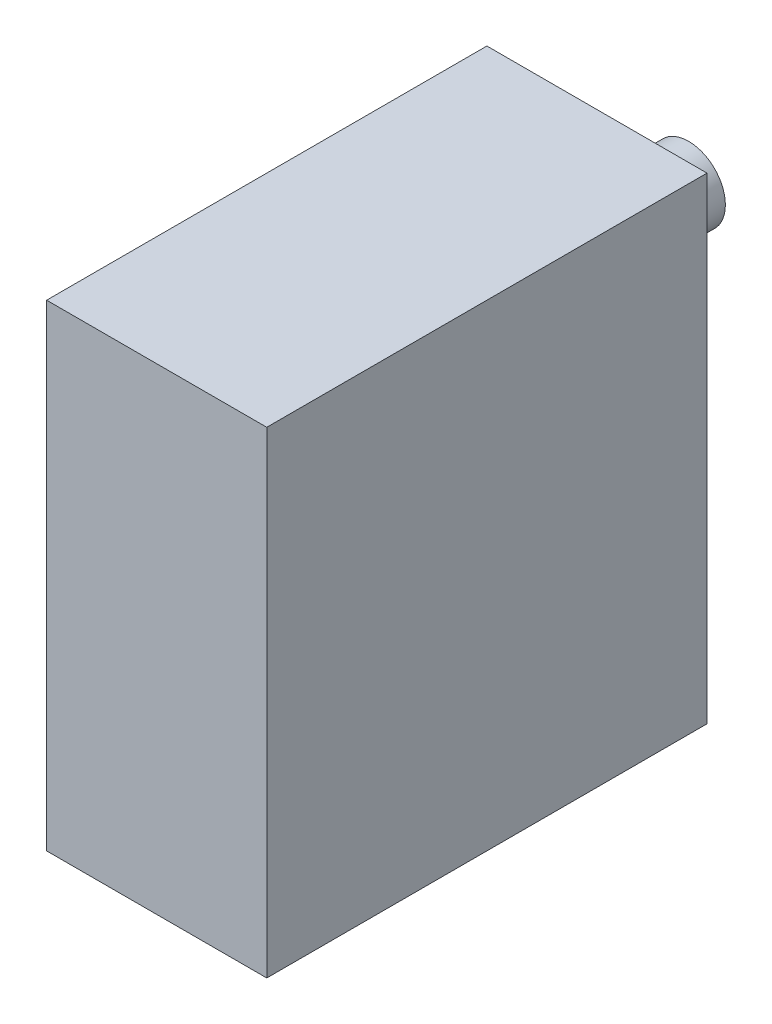
ISO-10303-21;
HEADER;
FILE_DESCRIPTION(('STEP AP214'),'2;1');
FILE_NAME('part.step','',(''),(''),'','','');
FILE_SCHEMA(('AUTOMOTIVE_DESIGN { 1 0 10303 214 1 1 1 1 }'));
ENDSEC;
DATA;
#1=APPLICATION_CONTEXT('core data for automotive mechanical design processes');
#2=APPLICATION_PROTOCOL_DEFINITION('international standard','automotive_design',2000,#1);
#3=PRODUCT_CONTEXT('',#1,'mechanical');
#4=PRODUCT('Part','Part','',(#3));
#5=PRODUCT_RELATED_PRODUCT_CATEGORY('part','',(#4));
#6=PRODUCT_DEFINITION_FORMATION('','',#4);
#7=PRODUCT_DEFINITION_CONTEXT('part definition',#1,'design');
#8=PRODUCT_DEFINITION('design','',#6,#7);
#9=PRODUCT_DEFINITION_SHAPE('','',#8);
#10=(LENGTH_UNIT() NAMED_UNIT(*) SI_UNIT(.MILLI.,.METRE.));
#11=(NAMED_UNIT(*) PLANE_ANGLE_UNIT() SI_UNIT($,.RADIAN.));
#12=(NAMED_UNIT(*) SI_UNIT($,.STERADIAN.) SOLID_ANGLE_UNIT());
#13=UNCERTAINTY_MEASURE_WITH_UNIT(LENGTH_MEASURE(1.E-05),#10,'distance_accuracy_value','');
#14=(GEOMETRIC_REPRESENTATION_CONTEXT(3) GLOBAL_UNCERTAINTY_ASSIGNED_CONTEXT((#13)) GLOBAL_UNIT_ASSIGNED_CONTEXT((#10,
#11,#12)) REPRESENTATION_CONTEXT('',''));
#15=CARTESIAN_POINT('',(0.,0.,0.));
#16=DIRECTION('',(0.,0.,1.));
#17=DIRECTION('',(1.,0.,0.));
#18=AXIS2_PLACEMENT_3D('',#15,#16,#17);
#19=CARTESIAN_POINT('',(9.525,20.6375,38.1));
#20=DIRECTION('',(-1.,0.,0.));
#21=DIRECTION('',(0.,-1.,0.));
#22=AXIS2_PLACEMENT_3D('',#19,#20,#21);
#23=PLANE('',#22);
#24=DIRECTION('',(0.,1.,0.));
#25=VECTOR('',#24,1.);
#26=CARTESIAN_POINT('',(9.525,20.6375,0.));
#27=LINE('',#26,#25);
#28=CARTESIAN_POINT('',(9.525,-20.6375,0.));
#29=VERTEX_POINT('',#28);
#30=CARTESIAN_POINT('',(9.525,20.6375,0.));
#31=VERTEX_POINT('',#30);
#32=EDGE_CURVE('E101',#29,#31,#27,.T.);
#33=ORIENTED_EDGE('',*,*,#32,.T.);
#34=DIRECTION('',(0.,0.,-1.));
#35=VECTOR('',#34,1.);
#36=CARTESIAN_POINT('',(9.525,20.6375,38.1));
#37=LINE('',#36,#35);
#38=CARTESIAN_POINT('',(9.525,20.6375,38.1));
#39=VERTEX_POINT('',#38);
#40=EDGE_CURVE('E43',#39,#31,#37,.T.);
#41=ORIENTED_EDGE('',*,*,#40,.F.);
#42=DIRECTION('',(0.,1.,0.));
#43=VECTOR('',#42,1.);
#44=CARTESIAN_POINT('',(9.525,20.6375,38.1));
#45=LINE('',#44,#43);
#46=CARTESIAN_POINT('',(9.525,-20.6375,38.1));
#47=VERTEX_POINT('',#46);
#48=EDGE_CURVE('E87',#47,#39,#45,.T.);
#49=ORIENTED_EDGE('',*,*,#48,.F.);
#50=DIRECTION('',(0.,0.,-1.));
#51=VECTOR('',#50,1.);
#52=CARTESIAN_POINT('',(9.525,-20.6375,38.1));
#53=LINE('',#52,#51);
#54=EDGE_CURVE('E97',#47,#29,#53,.T.);
#55=ORIENTED_EDGE('',*,*,#54,.T.);
#56=EDGE_LOOP('',(#33,#41,#49,#55));
#57=FACE_BOUND('',#56,.T.);
#58=ADVANCED_FACE('F35',(#57),#23,.F.);
#59=CARTESIAN_POINT('',(-9.525,20.6375,38.1));
#60=DIRECTION('',(0.,-1.,0.));
#61=DIRECTION('',(0.,0.,-1.));
#62=AXIS2_PLACEMENT_3D('',#59,#60,#61);
#63=PLANE('',#62);
#64=DIRECTION('',(-1.,0.,0.));
#65=VECTOR('',#64,1.);
#66=CARTESIAN_POINT('',(-9.525,20.6375,0.));
#67=LINE('',#66,#65);
#68=CARTESIAN_POINT('',(-9.525,20.6375,0.));
#69=VERTEX_POINT('',#68);
#70=EDGE_CURVE('E92',#31,#69,#67,.T.);
#71=ORIENTED_EDGE('',*,*,#70,.T.);
#72=DIRECTION('',(0.,0.,-1.));
#73=VECTOR('',#72,1.);
#74=CARTESIAN_POINT('',(-9.525,20.6375,38.1));
#75=LINE('',#74,#73);
#76=CARTESIAN_POINT('',(-9.525,20.6375,38.1));
#77=VERTEX_POINT('',#76);
#78=EDGE_CURVE('E90',#77,#69,#75,.T.);
#79=ORIENTED_EDGE('',*,*,#78,.F.);
#80=DIRECTION('',(-1.,0.,0.));
#81=VECTOR('',#80,1.);
#82=CARTESIAN_POINT('',(-9.525,20.6375,38.1));
#83=LINE('',#82,#81);
#84=EDGE_CURVE('E82',#39,#77,#83,.T.);
#85=ORIENTED_EDGE('',*,*,#84,.F.);
#86=ORIENTED_EDGE('',*,*,#40,.T.);
#87=EDGE_LOOP('',(#71,#79,#85,#86));
#88=FACE_BOUND('',#87,.T.);
#89=ADVANCED_FACE('F91',(#88),#63,.F.);
#90=CARTESIAN_POINT('',(-9.525,20.6375,38.1));
#91=DIRECTION('',(1.,0.,0.));
#92=DIRECTION('',(0.,1.,0.));
#93=AXIS2_PLACEMENT_3D('',#90,#91,#92);
#94=PLANE('',#93);
#95=DIRECTION('',(0.,-1.,0.));
#96=VECTOR('',#95,1.);
#97=CARTESIAN_POINT('',(-9.525,20.6375,0.));
#98=LINE('',#97,#96);
#99=CARTESIAN_POINT('',(-9.525,-20.6375,0.));
#100=VERTEX_POINT('',#99);
#101=EDGE_CURVE('E68',#69,#100,#98,.T.);
#102=ORIENTED_EDGE('',*,*,#101,.T.);
#103=DIRECTION('',(0.,0.,-1.));
#104=VECTOR('',#103,1.);
#105=CARTESIAN_POINT('',(-9.525,-20.6375,38.1));
#106=LINE('',#105,#104);
#107=CARTESIAN_POINT('',(-9.525,-20.6375,38.1));
#108=VERTEX_POINT('',#107);
#109=EDGE_CURVE('E93',#108,#100,#106,.T.);
#110=ORIENTED_EDGE('',*,*,#109,.F.);
#111=DIRECTION('',(0.,-1.,0.));
#112=VECTOR('',#111,1.);
#113=CARTESIAN_POINT('',(-9.525,20.6375,38.1));
#114=LINE('',#113,#112);
#115=EDGE_CURVE('E85',#77,#108,#114,.T.);
#116=ORIENTED_EDGE('',*,*,#115,.F.);
#117=ORIENTED_EDGE('',*,*,#78,.T.);
#118=EDGE_LOOP('',(#102,#110,#116,#117));
#119=FACE_BOUND('',#118,.T.);
#120=ADVANCED_FACE('F95',(#119),#94,.F.);
#121=CARTESIAN_POINT('',(-9.525,-20.6375,38.1));
#122=DIRECTION('',(0.,1.,0.));
#123=DIRECTION('',(0.,0.,1.));
#124=AXIS2_PLACEMENT_3D('',#121,#122,#123);
#125=PLANE('',#124);
#126=DIRECTION('',(1.,0.,0.));
#127=VECTOR('',#126,1.);
#128=CARTESIAN_POINT('',(-9.525,-20.6375,0.));
#129=LINE('',#128,#127);
#130=EDGE_CURVE('E74',#100,#29,#129,.T.);
#131=ORIENTED_EDGE('',*,*,#130,.T.);
#132=ORIENTED_EDGE('',*,*,#54,.F.);
#133=DIRECTION('',(1.,0.,0.));
#134=VECTOR('',#133,1.);
#135=CARTESIAN_POINT('',(-9.525,-20.6375,38.1));
#136=LINE('',#135,#134);
#137=EDGE_CURVE('E51',#108,#47,#136,.T.);
#138=ORIENTED_EDGE('',*,*,#137,.F.);
#139=ORIENTED_EDGE('',*,*,#109,.T.);
#140=EDGE_LOOP('',(#131,#132,#138,#139));
#141=FACE_BOUND('',#140,.T.);
#142=ADVANCED_FACE('F124',(#141),#125,.F.);
#143=CARTESIAN_POINT('',(0.,0.,38.1));
#144=DIRECTION('',(0.,0.,1.));
#145=DIRECTION('',(1.,0.,0.));
#146=AXIS2_PLACEMENT_3D('',#143,#144,#145);
#147=PLANE('',#146);
#148=ORIENTED_EDGE('',*,*,#48,.T.);
#149=ORIENTED_EDGE('',*,*,#84,.T.);
#150=ORIENTED_EDGE('',*,*,#115,.T.);
#151=ORIENTED_EDGE('',*,*,#137,.T.);
#152=EDGE_LOOP('',(#148,#149,#150,#151));
#153=FACE_BOUND('',#152,.T.);
#154=ADVANCED_FACE('F83',(#153),#147,.T.);
#155=CARTESIAN_POINT('',(0.,0.,0.));
#156=DIRECTION('',(0.,0.,1.));
#157=DIRECTION('',(1.,0.,0.));
#158=AXIS2_PLACEMENT_3D('',#155,#156,#157);
#159=PLANE('',#158);
#160=CARTESIAN_POINT('',(0.,11.1125,0.));
#161=DIRECTION('',(0.,0.,1.));
#162=DIRECTION('',(1.,0.,0.));
#163=AXIS2_PLACEMENT_3D('',#160,#161,#162);
#164=CIRCLE('',#163,3.175);
#165=CARTESIAN_POINT('',(3.175,11.1125,0.));
#166=VERTEX_POINT('',#165);
#167=EDGE_CURVE('E11',#166,#166,#164,.F.);
#168=ORIENTED_EDGE('',*,*,#167,.F.);
#169=EDGE_LOOP('',(#168));
#170=FACE_BOUND('',#169,.T.);
#171=ORIENTED_EDGE('',*,*,#32,.F.);
#172=ORIENTED_EDGE('',*,*,#130,.F.);
#173=ORIENTED_EDGE('',*,*,#101,.F.);
#174=ORIENTED_EDGE('',*,*,#70,.F.);
#175=EDGE_LOOP('',(#171,#172,#173,#174));
#176=FACE_BOUND('',#175,.T.);
#177=ADVANCED_FACE('F112',(#170,#176),#159,.F.);
#178=CARTESIAN_POINT('',(0.,11.1125,-7.9375));
#179=DIRECTION('',(0.,0.,1.));
#180=DIRECTION('',(1.,0.,0.));
#181=AXIS2_PLACEMENT_3D('',#178,#179,#180);
#182=CYLINDRICAL_SURFACE('',#181,3.175);
#183=CARTESIAN_POINT('',(0.,11.1125,-7.9375));
#184=DIRECTION('',(0.,0.,-1.));
#185=DIRECTION('',(-1.,0.,0.));
#186=AXIS2_PLACEMENT_3D('',#183,#184,#185);
#187=CIRCLE('',#186,3.175);
#188=CARTESIAN_POINT('',(-3.175,11.1125,-7.9375));
#189=VERTEX_POINT('',#188);
#190=EDGE_CURVE('E104',#189,#189,#187,.T.);
#191=ORIENTED_EDGE('',*,*,#190,.F.);
#192=EDGE_LOOP('',(#191));
#193=FACE_BOUND('',#192,.T.);
#194=ORIENTED_EDGE('',*,*,#167,.T.);
#195=EDGE_LOOP('',(#194));
#196=FACE_BOUND('',#195,.T.);
#197=ADVANCED_FACE('F114',(#193,#196),#182,.T.);
#198=CARTESIAN_POINT('',(0.,11.1125,-7.9375));
#199=DIRECTION('',(0.,0.,-1.));
#200=DIRECTION('',(-1.,0.,0.));
#201=AXIS2_PLACEMENT_3D('',#198,#199,#200);
#202=PLANE('',#201);
#203=ORIENTED_EDGE('',*,*,#190,.T.);
#204=EDGE_LOOP('',(#203));
#205=FACE_BOUND('',#204,.T.);
#206=ADVANCED_FACE('F121',(#205),#202,.T.);
#207=CLOSED_SHELL('',(#58,#89,#120,#142,#154,#177,#197,#206));
#208=MANIFOLD_SOLID_BREP('B2',#207);
#209=ADVANCED_BREP_SHAPE_REPRESENTATION('',(#18,#208),#14);
#210=SHAPE_DEFINITION_REPRESENTATION(#9,#209);
ENDSEC;
END-ISO-10303-21;
